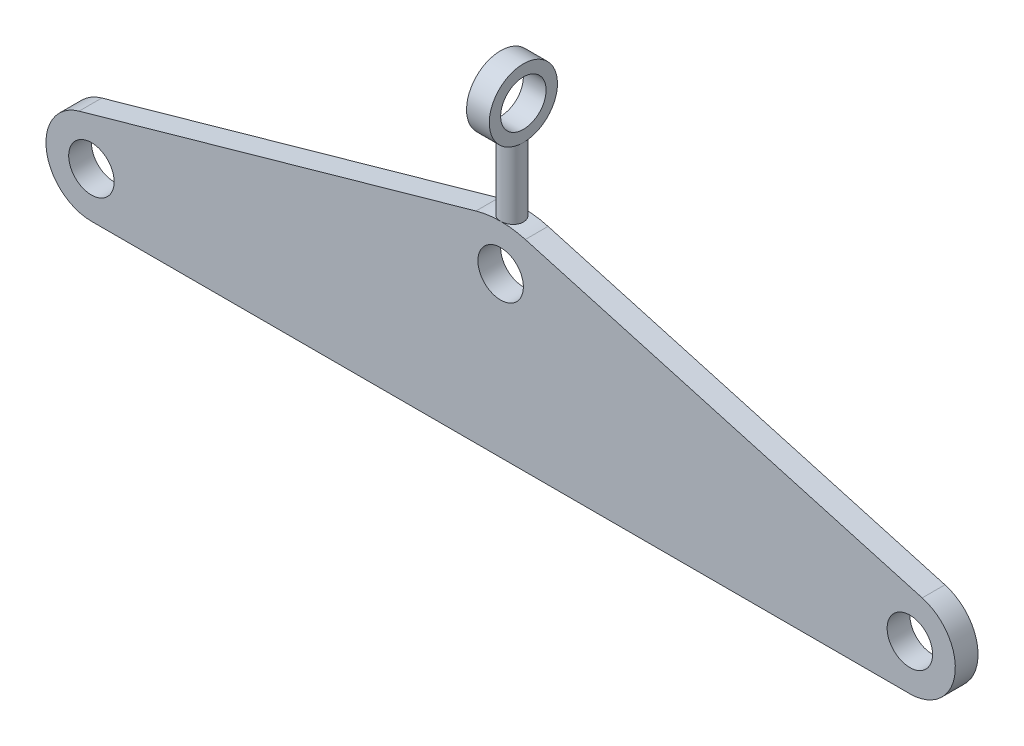
ISO-10303-21;
HEADER;
FILE_DESCRIPTION(('STEP AP214'),'2;1');
FILE_NAME('part.step','',(''),(''),'','','');
FILE_SCHEMA(('AUTOMOTIVE_DESIGN { 1 0 10303 214 1 1 1 1 }'));
ENDSEC;
DATA;
#1=APPLICATION_CONTEXT('core data for automotive mechanical design processes');
#2=APPLICATION_PROTOCOL_DEFINITION('international standard','automotive_design',2000,#1);
#3=PRODUCT_CONTEXT('',#1,'mechanical');
#4=PRODUCT('Part','Part','',(#3));
#5=PRODUCT_RELATED_PRODUCT_CATEGORY('part','',(#4));
#6=PRODUCT_DEFINITION_FORMATION('','',#4);
#7=PRODUCT_DEFINITION_CONTEXT('part definition',#1,'design');
#8=PRODUCT_DEFINITION('design','',#6,#7);
#9=PRODUCT_DEFINITION_SHAPE('','',#8);
#10=(LENGTH_UNIT() NAMED_UNIT(*) SI_UNIT(.MILLI.,.METRE.));
#11=(NAMED_UNIT(*) PLANE_ANGLE_UNIT() SI_UNIT($,.RADIAN.));
#12=(NAMED_UNIT(*) SI_UNIT($,.STERADIAN.) SOLID_ANGLE_UNIT());
#13=UNCERTAINTY_MEASURE_WITH_UNIT(LENGTH_MEASURE(1.E-05),#10,'distance_accuracy_value','');
#14=(GEOMETRIC_REPRESENTATION_CONTEXT(3) GLOBAL_UNCERTAINTY_ASSIGNED_CONTEXT((#13)) GLOBAL_UNIT_ASSIGNED_CONTEXT((#10,
#11,#12)) REPRESENTATION_CONTEXT('',''));
#15=CARTESIAN_POINT('',(0.,0.,0.));
#16=DIRECTION('',(0.,0.,1.));
#17=DIRECTION('',(1.,0.,0.));
#18=AXIS2_PLACEMENT_3D('',#15,#16,#17);
#19=CARTESIAN_POINT('',(0.,49.9999999999999,10.));
#20=DIRECTION('',(0.,0.,-1.));
#21=DIRECTION('',(-1.,0.,0.));
#22=AXIS2_PLACEMENT_3D('',#19,#20,#21);
#23=CYLINDRICAL_SURFACE('',#22,39.9999999999999);
#24=CARTESIAN_POINT('',(0.,49.9999999999999,0.));
#25=DIRECTION('',(0.,0.,1.));
#26=DIRECTION('',(1.,0.,0.));
#27=AXIS2_PLACEMENT_3D('',#24,#25,#26);
#28=CIRCLE('',#27,39.9999999999999);
#29=CARTESIAN_POINT('',(10.8606692422404,88.4973487867754,0.));
#30=VERTEX_POINT('',#29);
#31=CARTESIAN_POINT('',(0.,89.9999999999998,0.));
#32=VERTEX_POINT('',#31);
#33=EDGE_CURVE('E173',#30,#32,#28,.T.);
#34=ORIENTED_EDGE('',*,*,#33,.T.);
#35=CARTESIAN_POINT('',(0.,89.9999999999998,0.));
#36=CARTESIAN_POINT('',(0.139890119905129,90.0000005381635,-1.60544366538232E-06));
#37=CARTESIAN_POINT('',(0.279756672055419,89.9992647084953,0.00587286946751318));
#38=CARTESIAN_POINT('',(0.558534146473235,89.9963430990471,0.0293256522656745));
#39=CARTESIAN_POINT('',(0.697444844924119,89.9941569906196,0.0469066129627251));
#40=CARTESIAN_POINT('',(0.973374569297796,89.9883933720994,0.0936632564356594));
#41=CARTESIAN_POINT('',(1.11039210784001,89.9848148259738,0.122847572954619));
#42=CARTESIAN_POINT('',(1.38150954879871,89.9763659190363,0.192606689859553));
#43=CARTESIAN_POINT('',(1.51560836311209,89.9714950850906,0.233185662387908));
#44=CARTESIAN_POINT('',(1.77974867952928,89.9606049872553,0.325383197050408));
#45=CARTESIAN_POINT('',(1.90979428479121,89.9545869317718,0.37699014991022));
#46=CARTESIAN_POINT('',(2.16511159371552,89.9415653040232,0.490915781149526));
#47=CARTESIAN_POINT('',(2.29038151829058,89.93456136896,0.553238404713552));
#48=CARTESIAN_POINT('',(2.53515746693699,89.9197695937797,0.6880988259054));
#49=CARTESIAN_POINT('',(2.65466661068783,89.9119821851603,0.760631009312634));
#50=CARTESIAN_POINT('',(2.88721115185143,89.89583441741,0.91545219221617));
#51=CARTESIAN_POINT('',(3.00024412947132,89.8874738466495,0.997744803849317));
#52=CARTESIAN_POINT('',(3.2195068068404,89.8703765416527,1.17188491800446));
#53=CARTESIAN_POINT('',(3.32570323025804,89.861638269672,1.26377417064855));
#54=CARTESIAN_POINT('',(3.53002741979653,89.8440638930872,1.45618755632825));
#55=CARTESIAN_POINT('',(3.62815218732707,89.8352277534964,1.55671487026917));
#56=CARTESIAN_POINT('',(3.81557488779227,89.8177127277209,1.76564129127892));
#57=CARTESIAN_POINT('',(3.90487560711771,89.8090337926069,1.87403789456726));
#58=CARTESIAN_POINT('',(4.07409000497663,89.7920724042626,2.0980181969404));
#59=CARTESIAN_POINT('',(4.15400020829439,89.7837900984834,2.21360453273157));
#60=CARTESIAN_POINT('',(4.30405460761977,89.7678365901148,2.45148132538977));
#61=CARTESIAN_POINT('',(4.37416871629248,89.7601672998985,2.57379089547266));
#62=CARTESIAN_POINT('',(4.50386359810221,89.7456849515382,2.82397679510494));
#63=CARTESIAN_POINT('',(4.56344045265627,89.7388722121986,2.95185517363818));
#64=CARTESIAN_POINT('',(4.67157237881494,89.7263059358326,3.2121914879194));
#65=CARTESIAN_POINT('',(4.72013184632197,89.7205519765301,3.34464757278262));
#66=CARTESIAN_POINT('',(4.80591459607033,89.7102634489655,3.61324144907418));
#67=CARTESIAN_POINT('',(4.84313371513166,89.7057293285924,3.74938057266943));
#68=CARTESIAN_POINT('',(4.93694468367964,89.6942156965829,4.16032972480139));
#69=CARTESIAN_POINT('',(4.97637915708482,89.6892420541928,4.43933600976206));
#70=CARTESIAN_POINT('',(5.00788537091916,89.6852781774934,4.99989503088064));
#71=CARTESIAN_POINT('',(4.99995901599065,89.6862877025676,5.28144766418104));
#72=CARTESIAN_POINT('',(4.9372306806791,89.6941397412187,5.8375983606111));
#73=CARTESIAN_POINT('',(4.88269650974368,89.7009489290564,6.11222694590209));
#74=CARTESIAN_POINT('',(4.72870178261049,89.7195838252989,6.64839306899777));
#75=CARTESIAN_POINT('',(4.62924031615997,89.731409635343,6.90993034144571));
#76=CARTESIAN_POINT('',(4.38793084641351,89.75878236299,7.41333518378114));
#77=CARTESIAN_POINT('',(4.24596643413695,89.7743394764763,7.65514638226275));
#78=CARTESIAN_POINT('',(3.92376301219559,89.8074142163636,8.11161360707176));
#79=CARTESIAN_POINT('',(3.7435222518603,89.8249319324207,8.32626839061152));
#80=CARTESIAN_POINT('',(3.34839820167268,89.8601022011234,8.72388536237581));
#81=CARTESIAN_POINT('',(3.13328401036469,89.8777548486257,8.90661816770986));
#82=CARTESIAN_POINT('',(2.67531434354325,89.9110926502287,9.23341777588332));
#83=CARTESIAN_POINT('',(2.43245880406304,89.9267777997925,9.37748448956285));
#84=CARTESIAN_POINT('',(1.92572334129999,89.9544230446088,9.62286263670766));
#85=CARTESIAN_POINT('',(1.66183639028545,89.9663818880917,9.7241597067116));
#86=CARTESIAN_POINT('',(1.12061588125211,89.9852157155399,9.88094098809741));
#87=CARTESIAN_POINT('',(0.843282953394377,89.9920909375099,9.93642734425763));
#88=CARTESIAN_POINT('',(0.285026327694858,89.9999519282222,9.99971484853757));
#89=CARTESIAN_POINT('',(0.0041389802552028,90.0009767228209,10.0078319858305));
#90=CARTESIAN_POINT('',(-0.554992072852981,89.99712676014,9.9769845307859));
#91=CARTESIAN_POINT('',(-0.833235834693511,89.9922521284977,9.93802094110431));
#92=CARTESIAN_POINT('',(-1.37824901587752,89.9771753750005,9.81438058682941));
#93=CARTESIAN_POINT('',(-1.64505314244337,89.9669908157767,9.72985448958346));
#94=CARTESIAN_POINT('',(-2.16069930812282,89.9424344625042,9.51764507978498));
#95=CARTESIAN_POINT('',(-2.409540736989,89.9280625262811,9.38996030183757));
#96=CARTESIAN_POINT('',(-2.88360904734716,89.8966364563236,9.09429378648024));
#97=CARTESIAN_POINT('',(-3.10870754222789,89.8795688738225,8.92610765044472));
#98=CARTESIAN_POINT('',(-3.52759395691155,89.8447028535407,8.55450077486656));
#99=CARTESIAN_POINT('',(-3.72138063328027,89.8269043867707,8.35107863671948));
#100=CARTESIAN_POINT('',(-4.07326400150429,89.7924620828692,7.91338603015325));
#101=CARTESIAN_POINT('',(-4.23115123496748,89.7758253957048,7.6789465391907));
#102=CARTESIAN_POINT('',(-4.50530546506176,89.7457083194623,7.18668027854395));
#103=CARTESIAN_POINT('',(-4.62157329603305,89.7322278671134,6.9288539778228));
#104=CARTESIAN_POINT('',(-4.80885432607943,89.7099966403347,6.39786139323801));
#105=CARTESIAN_POINT('',(-4.87998560998226,89.7012335337282,6.1247371880326));
#106=CARTESIAN_POINT('',(-4.97533563287035,89.6893996880526,5.57015018639667));
#107=CARTESIAN_POINT('',(-4.99955655425284,89.6863286841718,5.28868777850052));
#108=CARTESIAN_POINT('',(-5.00021203982543,89.6862413860478,4.86770509968356));
#109=CARTESIAN_POINT('',(-4.99455342448893,89.6869567678297,4.7279907744482));
#110=CARTESIAN_POINT('',(-4.97156759842697,89.6898435691375,4.44955449545923));
#111=CARTESIAN_POINT('',(-4.95424473440735,89.6920144462687,4.3108321914815));
#112=CARTESIAN_POINT('',(-4.90804527126822,89.6977533828974,4.03531296162436));
#113=CARTESIAN_POINT('',(-4.8791644700839,89.7013219505366,3.89851675475211));
#114=CARTESIAN_POINT('',(-4.81007786270753,89.7097514776593,3.62790627625881));
#115=CARTESIAN_POINT('',(-4.76987617588937,89.7146119670104,3.49409093905426));
#116=CARTESIAN_POINT('',(-4.67843682035611,89.7254873627672,3.23033559589054));
#117=CARTESIAN_POINT('',(-4.62719918212894,89.7315022659838,3.10039557922654));
#118=CARTESIAN_POINT('',(-4.51407883701008,89.7445132115211,2.84534293691755));
#119=CARTESIAN_POINT('',(-4.45219999438846,89.7515088975083,2.72022857899437));
#120=CARTESIAN_POINT('',(-4.31820085845315,89.7662882864808,2.4755993921102));
#121=CARTESIAN_POINT('',(-4.24607681362519,89.7740722778209,2.35608663571795));
#122=CARTESIAN_POINT('',(-4.09214062508197,89.7902044420042,2.12357551708676));
#123=CARTESIAN_POINT('',(-4.01033196639703,89.7985524114373,2.01057483309643));
#124=CARTESIAN_POINT('',(-3.83696646630911,89.8156417227914,1.79104567958628));
#125=CARTESIAN_POINT('',(-3.74534501263956,89.8243854215876,1.68456841212598));
#126=CARTESIAN_POINT('',(-3.5535108005909,89.841960696595,1.47973821996224));
#127=CARTESIAN_POINT('',(-3.45330116889785,89.8507922397984,1.3813823638989));
#128=CARTESIAN_POINT('',(-3.24489676777315,89.8683029909286,1.19338064270281));
#129=CARTESIAN_POINT('',(-3.13669721323722,89.8769821036511,1.10374007275859));
#130=CARTESIAN_POINT('',(-2.91316118457665,89.893934986293,0.933897628967268));
#131=CARTESIAN_POINT('',(-2.79782736151181,89.9022089047573,0.853692280805405));
#132=CARTESIAN_POINT('',(-2.56029300186375,89.9181553288821,0.702934784657389));
#133=CARTESIAN_POINT('',(-2.43806574742476,89.9258251726458,0.632424441172079));
#134=CARTESIAN_POINT('',(-2.18809688735153,89.9403041894307,0.501989324481662));
#135=CARTESIAN_POINT('',(-2.06035732624459,89.9471136779406,0.442060667791041));
#136=CARTESIAN_POINT('',(-1.80032528471159,89.9596765836334,0.333237180143856));
#137=CARTESIAN_POINT('',(-1.66803644956569,89.9654308239913,0.284333741774115));
#138=CARTESIAN_POINT('',(-1.39980201837414,89.9757248289653,0.19787412284095));
#139=CARTESIAN_POINT('',(-1.26385729314416,89.9802648800244,0.160315265671807));
#140=CARTESIAN_POINT('',(-0.942088347754191,89.9893293227842,0.0859095142172747));
#141=CARTESIAN_POINT('',(-0.755150897758084,89.9933140899318,0.0537266080812142));
#142=CARTESIAN_POINT('',(-0.378794555992445,89.9986490545574,0.0107730166012728));
#143=CARTESIAN_POINT('',(-0.189375682531538,89.9999992714628,2.17336277394988E-06));
#144=CARTESIAN_POINT('',(0.,89.9999999999998,0.));
#145=B_SPLINE_CURVE_WITH_KNOTS('',3,(#35,#36,#37,#38,#39,#40,#41,#42,#43,#44,#45,#46,#47,#48,
#49,#50,#51,#52,#53,#54,#55,#56,#57,#58,#59,#60,#61,#62,#63,#64,#65,#66,#67,#68,#69,#70,#71,#72,
#73,#74,#75,#76,#77,#78,#79,#80,#81,#82,#83,#84,#85,#86,#87,#88,#89,#90,#91,#92,#93,#94,#95,#96,
#97,#98,#99,#100,#101,#102,#103,#104,#105,#106,#107,#108,#109,#110,#111,#112,#113,#114,#115,
#116,#117,#118,#119,#120,#121,#122,#123,#124,#125,#126,#127,#128,#129,#130,#131,#132,#133,#134,
#135,#136,#137,#138,#139,#140,#141,#142,#143,#144),.UNSPECIFIED.,.T.,.F.,(4,2,2,2,2,2,2,2,2,2,2,
2,2,2,2,2,2,2,2,2,2,2,2,2,2,2,2,2,2,2,2,2,2,2,2,2,2,2,2,2,2,2,2,2,2,2,2,2,2,2,2,2,2,2,4),(0.,
0.41950463782399,0.839104372080584,1.25901690519861,1.6790833898206,2.0987098253965,
2.51849108679869,2.93804240646987,3.35774948092481,3.77936522319644,4.20113689336975,
4.62277495120627,5.044568559516,5.46763043530053,5.8908493096016,6.3138990227869,
6.73710385606702,7.5781725718573,8.41920746382417,9.25544199496474,10.0916934694557,
10.9302565918416,11.7688580764037,12.6132576288593,13.4576591283932,14.302343980763,
15.1469892842066,15.9859936539694,16.8249801561695,17.6612091439989,18.4974665277099,
19.3380361246994,20.1786390936328,21.0240274962825,21.8693989505618,22.7125495517495,
23.5556609263435,23.9747450940198,24.3936731755016,24.8127537032624,25.2316819351988,
25.6506090098188,26.0693842743665,26.4883132802121,26.9070919891526,27.3288208308208,
27.7503967812451,28.1722272905919,28.5939019805892,29.0173414250539,29.4406251425129,
29.8635772481615,30.2864294856978,30.8543363757697,31.4222390780259),.UNSPECIFIED.);
#146=CARTESIAN_POINT('',(0.,89.9999999999998,10.0000000000001));
#147=VERTEX_POINT('',#146);
#148=EDGE_CURVE('E62',#32,#147,#145,.T.);
#149=ORIENTED_EDGE('',*,*,#148,.T.);
#150=CARTESIAN_POINT('',(0.,49.9999999999999,10.));
#151=DIRECTION('',(0.,0.,1.));
#152=DIRECTION('',(1.,0.,0.));
#153=AXIS2_PLACEMENT_3D('',#150,#151,#152);
#154=CIRCLE('',#153,39.9999999999999);
#155=CARTESIAN_POINT('',(10.8606692422404,88.4973487867754,10.));
#156=VERTEX_POINT('',#155);
#157=EDGE_CURVE('E224',#156,#147,#154,.T.);
#158=ORIENTED_EDGE('',*,*,#157,.F.);
#159=DIRECTION('',(0.,0.,-1.));
#160=VECTOR('',#159,1.);
#161=CARTESIAN_POINT('',(10.8606692422404,88.4973487867754,10.));
#162=LINE('',#161,#160);
#163=EDGE_CURVE('E175',#156,#30,#162,.T.);
#164=ORIENTED_EDGE('',*,*,#163,.T.);
#165=EDGE_LOOP('',(#34,#149,#158,#164));
#166=FACE_BOUND('',#165,.T.);
#167=ADVANCED_FACE('F38',(#166),#23,.T.);
#168=CARTESIAN_POINT('',(180.,20.,10.));
#169=DIRECTION('',(0.,0.,1.));
#170=DIRECTION('',(1.,0.,0.));
#171=AXIS2_PLACEMENT_3D('',#168,#169,#170);
#172=PLANE('',#171);
#173=CARTESIAN_POINT('',(0.,70.,10.));
#174=DIRECTION('',(0.,0.,1.));
#175=DIRECTION('',(1.,0.,0.));
#176=AXIS2_PLACEMENT_3D('',#173,#174,#175);
#177=CIRCLE('',#176,9.99999999999998);
#178=CARTESIAN_POINT('',(9.99999999999998,70.,10.));
#179=VERTEX_POINT('',#178);
#180=EDGE_CURVE('E231',#179,#179,#177,.T.);
#181=ORIENTED_EDGE('',*,*,#180,.F.);
#182=EDGE_LOOP('',(#181));
#183=FACE_BOUND('',#182,.T.);
#184=CARTESIAN_POINT('',(180.,20.,10.));
#185=DIRECTION('',(0.,0.,1.));
#186=DIRECTION('',(1.,0.,0.));
#187=AXIS2_PLACEMENT_3D('',#184,#185,#186);
#188=CIRCLE('',#187,19.9999999999999);
#189=CARTESIAN_POINT('',(180.,0.,10.));
#190=VERTEX_POINT('',#189);
#191=CARTESIAN_POINT('',(185.43033462112,39.2486743933876,10.));
#192=VERTEX_POINT('',#191);
#193=EDGE_CURVE('E189',#190,#192,#188,.T.);
#194=ORIENTED_EDGE('',*,*,#193,.T.);
#195=DIRECTION('',(-0.96243371966939,0.271516731056009,0.));
#196=VECTOR('',#195,1.);
#197=CARTESIAN_POINT('',(185.43033462112,39.2486743933876,10.));
#198=LINE('',#197,#196);
#199=EDGE_CURVE('E206',#192,#156,#198,.T.);
#200=ORIENTED_EDGE('',*,*,#199,.T.);
#201=ORIENTED_EDGE('',*,*,#157,.T.);
#202=CARTESIAN_POINT('',(-10.8606692422404,88.4973487867754,10.));
#203=VERTEX_POINT('',#202);
#204=EDGE_CURVE('E227',#147,#203,#154,.T.);
#205=ORIENTED_EDGE('',*,*,#204,.T.);
#206=DIRECTION('',(-0.96243371966939,-0.271516731056009,0.));
#207=VECTOR('',#206,1.);
#208=CARTESIAN_POINT('',(-10.8606692422404,88.4973487867754,10.));
#209=LINE('',#208,#207);
#210=CARTESIAN_POINT('',(-185.43033462112,39.2486743933878,10.));
#211=VERTEX_POINT('',#210);
#212=EDGE_CURVE('E222',#203,#211,#209,.T.);
#213=ORIENTED_EDGE('',*,*,#212,.T.);
#214=CARTESIAN_POINT('',(-180.,20.,10.));
#215=DIRECTION('',(0.,0.,1.));
#216=DIRECTION('',(-1.,0.,0.));
#217=AXIS2_PLACEMENT_3D('',#214,#215,#216);
#218=CIRCLE('',#217,19.9999999999999);
#219=CARTESIAN_POINT('',(-180.,0.,10.));
#220=VERTEX_POINT('',#219);
#221=EDGE_CURVE('E220',#211,#220,#218,.T.);
#222=ORIENTED_EDGE('',*,*,#221,.T.);
#223=DIRECTION('',(1.,0.,0.));
#224=VECTOR('',#223,1.);
#225=CARTESIAN_POINT('',(-180.,0.,10.));
#226=LINE('',#225,#224);
#227=EDGE_CURVE('E194',#220,#190,#226,.T.);
#228=ORIENTED_EDGE('',*,*,#227,.T.);
#229=EDGE_LOOP('',(#194,#200,#201,#205,#213,#222,#228));
#230=FACE_BOUND('',#229,.T.);
#231=CARTESIAN_POINT('',(180.,20.,10.));
#232=DIRECTION('',(0.,0.,1.));
#233=DIRECTION('',(1.,0.,0.));
#234=AXIS2_PLACEMENT_3D('',#231,#232,#233);
#235=CIRCLE('',#234,10.);
#236=CARTESIAN_POINT('',(190.,20.,10.));
#237=VERTEX_POINT('',#236);
#238=EDGE_CURVE('E214',#237,#237,#235,.T.);
#239=ORIENTED_EDGE('',*,*,#238,.F.);
#240=EDGE_LOOP('',(#239));
#241=FACE_BOUND('',#240,.T.);
#242=CARTESIAN_POINT('',(-180.,20.,10.));
#243=DIRECTION('',(0.,0.,1.));
#244=DIRECTION('',(1.,0.,0.));
#245=AXIS2_PLACEMENT_3D('',#242,#243,#244);
#246=CIRCLE('',#245,10.0000000000001);
#247=CARTESIAN_POINT('',(-170.,20.,10.));
#248=VERTEX_POINT('',#247);
#249=EDGE_CURVE('E236',#248,#248,#246,.T.);
#250=ORIENTED_EDGE('',*,*,#249,.F.);
#251=EDGE_LOOP('',(#250));
#252=FACE_BOUND('',#251,.T.);
#253=ADVANCED_FACE('F146',(#183,#230,#241,#252),#172,.T.);
#254=CARTESIAN_POINT('',(180.,20.,0.));
#255=DIRECTION('',(0.,0.,1.));
#256=DIRECTION('',(1.,0.,0.));
#257=AXIS2_PLACEMENT_3D('',#254,#255,#256);
#258=PLANE('',#257);
#259=CARTESIAN_POINT('',(180.,20.,0.));
#260=DIRECTION('',(0.,0.,1.));
#261=DIRECTION('',(1.,0.,0.));
#262=AXIS2_PLACEMENT_3D('',#259,#260,#261);
#263=CIRCLE('',#262,19.9999999999999);
#264=CARTESIAN_POINT('',(180.,0.,0.));
#265=VERTEX_POINT('',#264);
#266=CARTESIAN_POINT('',(185.43033462112,39.2486743933876,0.));
#267=VERTEX_POINT('',#266);
#268=EDGE_CURVE('E211',#265,#267,#263,.T.);
#269=ORIENTED_EDGE('',*,*,#268,.F.);
#270=DIRECTION('',(1.,0.,0.));
#271=VECTOR('',#270,1.);
#272=CARTESIAN_POINT('',(-180.,0.,0.));
#273=LINE('',#272,#271);
#274=CARTESIAN_POINT('',(-180.,0.,0.));
#275=VERTEX_POINT('',#274);
#276=EDGE_CURVE('E187',#275,#265,#273,.T.);
#277=ORIENTED_EDGE('',*,*,#276,.F.);
#278=CARTESIAN_POINT('',(-180.,20.,0.));
#279=DIRECTION('',(0.,0.,1.));
#280=DIRECTION('',(-1.,0.,0.));
#281=AXIS2_PLACEMENT_3D('',#278,#279,#280);
#282=CIRCLE('',#281,19.9999999999999);
#283=CARTESIAN_POINT('',(-185.43033462112,39.2486743933878,0.));
#284=VERTEX_POINT('',#283);
#285=EDGE_CURVE('E180',#284,#275,#282,.T.);
#286=ORIENTED_EDGE('',*,*,#285,.F.);
#287=DIRECTION('',(-0.96243371966939,-0.271516731056009,0.));
#288=VECTOR('',#287,1.);
#289=CARTESIAN_POINT('',(-10.8606692422404,88.4973487867754,0.));
#290=LINE('',#289,#288);
#291=CARTESIAN_POINT('',(-10.8606692422404,88.4973487867754,0.));
#292=VERTEX_POINT('',#291);
#293=EDGE_CURVE('E177',#292,#284,#290,.T.);
#294=ORIENTED_EDGE('',*,*,#293,.F.);
#295=EDGE_CURVE('E178',#32,#292,#28,.T.);
#296=ORIENTED_EDGE('',*,*,#295,.F.);
#297=ORIENTED_EDGE('',*,*,#33,.F.);
#298=DIRECTION('',(-0.96243371966939,0.271516731056009,0.));
#299=VECTOR('',#298,1.);
#300=CARTESIAN_POINT('',(185.43033462112,39.2486743933876,0.));
#301=LINE('',#300,#299);
#302=EDGE_CURVE('E182',#267,#30,#301,.T.);
#303=ORIENTED_EDGE('',*,*,#302,.F.);
#304=EDGE_LOOP('',(#269,#277,#286,#294,#296,#297,#303));
#305=FACE_BOUND('',#304,.T.);
#306=CARTESIAN_POINT('',(180.,20.,0.));
#307=DIRECTION('',(0.,0.,1.));
#308=DIRECTION('',(1.,0.,0.));
#309=AXIS2_PLACEMENT_3D('',#306,#307,#308);
#310=CIRCLE('',#309,10.);
#311=CARTESIAN_POINT('',(190.,20.,0.));
#312=VERTEX_POINT('',#311);
#313=EDGE_CURVE('E216',#312,#312,#310,.T.);
#314=ORIENTED_EDGE('',*,*,#313,.T.);
#315=EDGE_LOOP('',(#314));
#316=FACE_BOUND('',#315,.T.);
#317=CARTESIAN_POINT('',(0.,70.,0.));
#318=DIRECTION('',(0.,0.,1.));
#319=DIRECTION('',(1.,0.,0.));
#320=AXIS2_PLACEMENT_3D('',#317,#318,#319);
#321=CIRCLE('',#320,9.99999999999998);
#322=CARTESIAN_POINT('',(9.99999999999998,70.,0.));
#323=VERTEX_POINT('',#322);
#324=EDGE_CURVE('E233',#323,#323,#321,.T.);
#325=ORIENTED_EDGE('',*,*,#324,.T.);
#326=EDGE_LOOP('',(#325));
#327=FACE_BOUND('',#326,.T.);
#328=CARTESIAN_POINT('',(-180.,20.,0.));
#329=DIRECTION('',(0.,0.,1.));
#330=DIRECTION('',(1.,0.,0.));
#331=AXIS2_PLACEMENT_3D('',#328,#329,#330);
#332=CIRCLE('',#331,10.0000000000001);
#333=CARTESIAN_POINT('',(-170.,20.,0.));
#334=VERTEX_POINT('',#333);
#335=EDGE_CURVE('E239',#334,#334,#332,.T.);
#336=ORIENTED_EDGE('',*,*,#335,.T.);
#337=EDGE_LOOP('',(#336));
#338=FACE_BOUND('',#337,.T.);
#339=ADVANCED_FACE('F149',(#305,#316,#327,#338),#258,.F.);
#340=CARTESIAN_POINT('',(180.,20.,10.));
#341=DIRECTION('',(0.,0.,-1.));
#342=DIRECTION('',(-1.,0.,0.));
#343=AXIS2_PLACEMENT_3D('',#340,#341,#342);
#344=CYLINDRICAL_SURFACE('',#343,19.9999999999999);
#345=ORIENTED_EDGE('',*,*,#268,.T.);
#346=DIRECTION('',(0.,0.,-1.));
#347=VECTOR('',#346,1.);
#348=CARTESIAN_POINT('',(185.43033462112,39.2486743933876,10.));
#349=LINE('',#348,#347);
#350=EDGE_CURVE('E117',#192,#267,#349,.T.);
#351=ORIENTED_EDGE('',*,*,#350,.F.);
#352=ORIENTED_EDGE('',*,*,#193,.F.);
#353=DIRECTION('',(0.,0.,-1.));
#354=VECTOR('',#353,1.);
#355=CARTESIAN_POINT('',(180.,0.,10.));
#356=LINE('',#355,#354);
#357=EDGE_CURVE('E190',#190,#265,#356,.T.);
#358=ORIENTED_EDGE('',*,*,#357,.T.);
#359=EDGE_LOOP('',(#345,#351,#352,#358));
#360=FACE_BOUND('',#359,.T.);
#361=ADVANCED_FACE('F40',(#360),#344,.T.);
#362=CARTESIAN_POINT('',(185.43033462112,39.2486743933876,10.));
#363=DIRECTION('',(-0.271516731056009,-0.96243371966939,0.));
#364=DIRECTION('',(0.962433719669391,-0.271516731056009,0.));
#365=AXIS2_PLACEMENT_3D('',#362,#363,#364);
#366=PLANE('',#365);
#367=ORIENTED_EDGE('',*,*,#302,.T.);
#368=ORIENTED_EDGE('',*,*,#163,.F.);
#369=ORIENTED_EDGE('',*,*,#199,.F.);
#370=ORIENTED_EDGE('',*,*,#350,.T.);
#371=EDGE_LOOP('',(#367,#368,#369,#370));
#372=FACE_BOUND('',#371,.T.);
#373=ADVANCED_FACE('F166',(#372),#366,.F.);
#374=ORIENTED_EDGE('',*,*,#204,.F.);
#375=EDGE_CURVE('E112',#147,#32,#145,.T.);
#376=ORIENTED_EDGE('',*,*,#375,.T.);
#377=ORIENTED_EDGE('',*,*,#295,.T.);
#378=DIRECTION('',(0.,0.,-1.));
#379=VECTOR('',#378,1.);
#380=CARTESIAN_POINT('',(-10.8606692422404,88.4973487867754,10.));
#381=LINE('',#380,#379);
#382=EDGE_CURVE('E200',#203,#292,#381,.T.);
#383=ORIENTED_EDGE('',*,*,#382,.F.);
#384=EDGE_LOOP('',(#374,#376,#377,#383));
#385=FACE_BOUND('',#384,.T.);
#386=ADVANCED_FACE('F124',(#385),#23,.T.);
#387=CARTESIAN_POINT('',(-10.8606692422404,88.4973487867754,10.));
#388=DIRECTION('',(0.271516731056009,-0.96243371966939,0.));
#389=DIRECTION('',(0.962433719669391,0.27151673105601,0.));
#390=AXIS2_PLACEMENT_3D('',#387,#388,#389);
#391=PLANE('',#390);
#392=ORIENTED_EDGE('',*,*,#293,.T.);
#393=DIRECTION('',(0.,0.,-1.));
#394=VECTOR('',#393,1.);
#395=CARTESIAN_POINT('',(-185.43033462112,39.2486743933878,10.));
#396=LINE('',#395,#394);
#397=EDGE_CURVE('E197',#211,#284,#396,.T.);
#398=ORIENTED_EDGE('',*,*,#397,.F.);
#399=ORIENTED_EDGE('',*,*,#212,.F.);
#400=ORIENTED_EDGE('',*,*,#382,.T.);
#401=EDGE_LOOP('',(#392,#398,#399,#400));
#402=FACE_BOUND('',#401,.T.);
#403=ADVANCED_FACE('F159',(#402),#391,.F.);
#404=CARTESIAN_POINT('',(-180.,20.,10.));
#405=DIRECTION('',(0.,0.,-1.));
#406=DIRECTION('',(-1.,0.,0.));
#407=AXIS2_PLACEMENT_3D('',#404,#405,#406);
#408=CYLINDRICAL_SURFACE('',#407,19.9999999999999);
#409=ORIENTED_EDGE('',*,*,#285,.T.);
#410=DIRECTION('',(0.,0.,-1.));
#411=VECTOR('',#410,1.);
#412=CARTESIAN_POINT('',(-180.,0.,10.));
#413=LINE('',#412,#411);
#414=EDGE_CURVE('E193',#220,#275,#413,.T.);
#415=ORIENTED_EDGE('',*,*,#414,.F.);
#416=ORIENTED_EDGE('',*,*,#221,.F.);
#417=ORIENTED_EDGE('',*,*,#397,.T.);
#418=EDGE_LOOP('',(#409,#415,#416,#417));
#419=FACE_BOUND('',#418,.T.);
#420=ADVANCED_FACE('F156',(#419),#408,.T.);
#421=CARTESIAN_POINT('',(-180.,0.,10.));
#422=DIRECTION('',(0.,1.,0.));
#423=DIRECTION('',(0.,0.,1.));
#424=AXIS2_PLACEMENT_3D('',#421,#422,#423);
#425=PLANE('',#424);
#426=ORIENTED_EDGE('',*,*,#276,.T.);
#427=ORIENTED_EDGE('',*,*,#357,.F.);
#428=ORIENTED_EDGE('',*,*,#227,.F.);
#429=ORIENTED_EDGE('',*,*,#414,.T.);
#430=EDGE_LOOP('',(#426,#427,#428,#429));
#431=FACE_BOUND('',#430,.T.);
#432=ADVANCED_FACE('F144',(#431),#425,.F.);
#433=CARTESIAN_POINT('',(180.,20.,10.));
#434=DIRECTION('',(0.,0.,-1.));
#435=DIRECTION('',(-1.,0.,0.));
#436=AXIS2_PLACEMENT_3D('',#433,#434,#435);
#437=CYLINDRICAL_SURFACE('',#436,10.);
#438=ORIENTED_EDGE('',*,*,#238,.T.);
#439=EDGE_LOOP('',(#438));
#440=FACE_BOUND('',#439,.T.);
#441=ORIENTED_EDGE('',*,*,#313,.F.);
#442=EDGE_LOOP('',(#441));
#443=FACE_BOUND('',#442,.T.);
#444=ADVANCED_FACE('F140',(#440,#443),#437,.F.);
#445=CARTESIAN_POINT('',(0.,70.,10.));
#446=DIRECTION('',(0.,0.,-1.));
#447=DIRECTION('',(-1.,0.,0.));
#448=AXIS2_PLACEMENT_3D('',#445,#446,#447);
#449=CYLINDRICAL_SURFACE('',#448,9.99999999999998);
#450=ORIENTED_EDGE('',*,*,#180,.T.);
#451=EDGE_LOOP('',(#450));
#452=FACE_BOUND('',#451,.T.);
#453=ORIENTED_EDGE('',*,*,#324,.F.);
#454=EDGE_LOOP('',(#453));
#455=FACE_BOUND('',#454,.T.);
#456=ADVANCED_FACE('F136',(#452,#455),#449,.F.);
#457=CARTESIAN_POINT('',(-180.,20.,10.));
#458=DIRECTION('',(0.,0.,-1.));
#459=DIRECTION('',(-1.,0.,0.));
#460=AXIS2_PLACEMENT_3D('',#457,#458,#459);
#461=CYLINDRICAL_SURFACE('',#460,10.0000000000001);
#462=ORIENTED_EDGE('',*,*,#249,.T.);
#463=EDGE_LOOP('',(#462));
#464=FACE_BOUND('',#463,.T.);
#465=ORIENTED_EDGE('',*,*,#335,.F.);
#466=EDGE_LOOP('',(#465));
#467=FACE_BOUND('',#466,.T.);
#468=ADVANCED_FACE('F130',(#464,#467),#461,.F.);
#469=CARTESIAN_POINT('',(0.,125.,5.00000000000001));
#470=DIRECTION('',(0.,-1.,0.));
#471=DIRECTION('',(0.,0.,-1.));
#472=AXIS2_PLACEMENT_3D('',#469,#470,#471);
#473=CYLINDRICAL_SURFACE('',#472,5.00000000000004);
#474=CARTESIAN_POINT('',(0.,120.857864376269,0.));
#475=CARTESIAN_POINT('',(-0.272340874180362,120.857865273478,-1.28973859745586E-06));
#476=CARTESIAN_POINT('',(-0.544673999117968,120.849911535457,0.0223260815723556));
#477=CARTESIAN_POINT('',(-1.08127210497125,120.819121295937,0.110744341555926));
#478=CARTESIAN_POINT('',(-1.34553574936236,120.796282342891,0.176842439157982));
#479=CARTESIAN_POINT('',(-1.85813446498645,120.73858981556,0.350222571575445));
#480=CARTESIAN_POINT('',(-2.1064996472136,120.703759801434,0.457423892983743));
#481=CARTESIAN_POINT('',(-2.58180024273983,120.626043899484,0.709691857793068));
#482=CARTESIAN_POINT('',(-2.80873091276818,120.583156234819,0.854766855699059));
#483=CARTESIAN_POINT('',(-3.24359981169159,120.492275529626,1.18474426778559));
#484=CARTESIAN_POINT('',(-3.45057714335867,120.444155257768,1.37087829311038));
#485=CARTESIAN_POINT('',(-3.83103400612323,120.34930675995,1.77506166392801));
#486=CARTESIAN_POINT('',(-4.00450815791188,120.302578758552,1.99311612473811));
#487=CARTESIAN_POINT('',(-4.317394486648,120.21430665391,2.46197746017494));
#488=CARTESIAN_POINT('',(-4.45579985308983,120.17292961492,2.71349044387736));
#489=CARTESIAN_POINT('',(-4.68795792563759,120.101520661451,3.23784388506263));
#490=CARTESIAN_POINT('',(-4.78172266588457,120.07148568985,3.51067857156394));
#491=CARTESIAN_POINT('',(-4.91867927316201,120.027046228405,4.05985591283253));
#492=CARTESIAN_POINT('',(-4.96351723128508,120.012134261122,4.33574622573516));
#493=CARTESIAN_POINT('',(-5.00658146680334,119.997819589088,4.89151062587956));
#494=CARTESIAN_POINT('',(-5.00481975826211,119.998412886855,5.17138366771949));
#495=CARTESIAN_POINT('',(-4.9557787271699,120.014698019063,5.71551757596909));
#496=CARTESIAN_POINT('',(-4.9102873576276,120.029796762244,5.9799602429583));
#497=CARTESIAN_POINT('',(-4.77803509509768,120.072651633013,6.49721719411088));
#498=CARTESIAN_POINT('',(-4.69127140510092,120.100408618441,6.7500306888961));
#499=CARTESIAN_POINT('',(-4.47789341346975,120.166216485339,7.24076237420989));
#500=CARTESIAN_POINT('',(-4.35077030726748,120.204397873799,7.47844110484426));
#501=CARTESIAN_POINT('',(-4.06070147275676,120.287080348054,7.92962162763665));
#502=CARTESIAN_POINT('',(-3.89774578336188,120.331583189927,8.14311667192674));
#503=CARTESIAN_POINT('',(-3.53162803270154,120.424690407505,8.55050433275658));
#504=CARTESIAN_POINT('',(-3.32693421079263,120.473389241556,8.7430007853264));
#505=CARTESIAN_POINT('',(-2.88775637136694,120.567633237555,9.09138629799091));
#506=CARTESIAN_POINT('',(-2.65326777135981,120.613177912719,9.24726971640776));
#507=CARTESIAN_POINT('',(-2.15673187198282,120.696473743944,9.51993727517876));
#508=CARTESIAN_POINT('',(-1.89433934341115,120.734104535763,9.63613231810675));
#509=CARTESIAN_POINT('',(-1.35214302892793,120.795917458781,9.82221596634673));
#510=CARTESIAN_POINT('',(-1.07234659396878,120.820105225645,9.89212397873752));
#511=CARTESIAN_POINT('',(-0.516808222942136,120.851018184221,9.98080641048766));
#512=CARTESIAN_POINT('',(-0.241452876256726,120.858481984062,10.0017454775382));
#513=CARTESIAN_POINT('',(0.308880745570532,120.857166397041,9.99802719454865));
#514=CARTESIAN_POINT('',(0.583859080119943,120.848389960409,9.97337812613387));
#515=CARTESIAN_POINT('',(1.11578482855955,120.816319095485,9.8811282577616));
#516=CARTESIAN_POINT('',(1.37302715075421,120.793533727958,9.81503196990347));
#517=CARTESIAN_POINT('',(1.87271803119593,120.736572316449,9.64356931280239));
#518=CARTESIAN_POINT('',(2.11516395795391,120.702394253258,9.53819598181716));
#519=CARTESIAN_POINT('',(2.58690210423501,120.625156120211,9.28737170369473));
#520=CARTESIAN_POINT('',(2.81553321320903,120.581848716719,9.14075559179253));
#521=CARTESIAN_POINT('',(3.24573026191862,120.491711563452,8.81292815278784));
#522=CARTESIAN_POINT('',(3.44728819330612,120.44488077781,8.63170662749395));
#523=CARTESIAN_POINT('',(3.82763992045322,120.350248068108,8.22945852950167));
#524=CARTESIAN_POINT('',(4.00487195009428,120.302507821105,8.0069363527333));
#525=CARTESIAN_POINT('',(4.31958071174025,120.213657419345,7.53413645700132));
#526=CARTESIAN_POINT('',(4.45705885581216,120.172547029115,7.2838597243228));
#527=CARTESIAN_POINT('',(4.68710052430861,120.10177970947,6.76389931216151));
#528=CARTESIAN_POINT('',(4.77995638574037,120.072048499773,6.49435561660601));
#529=CARTESIAN_POINT('',(4.91863871030056,120.027069458111,5.94229232923011));
#530=CARTESIAN_POINT('',(4.96448214940256,120.011816398299,5.65977745976947));
#531=CARTESIAN_POINT('',(5.00631038802825,119.997906838187,5.10407667930022));
#532=CARTESIAN_POINT('',(5.00453726966193,119.998503995528,4.83107638039992));
#533=CARTESIAN_POINT('',(4.956713459268,120.01439017403,4.28944427499914));
#534=CARTESIAN_POINT('',(4.9106663592362,120.029678003321,4.02081211590472));
#535=CARTESIAN_POINT('',(4.77708882712023,120.072954252279,3.49978940283971));
#536=CARTESIAN_POINT('',(4.69022892323538,120.100737081943,3.24720864543605));
#537=CARTESIAN_POINT('',(4.47811234451427,120.166141964775,2.76010824530102));
#538=CARTESIAN_POINT('',(4.35284872401498,120.203765797599,2.52559187928783));
#539=CARTESIAN_POINT('',(4.06215243949,120.286706558606,2.07182991845607));
#540=CARTESIAN_POINT('',(3.89540657309184,120.332256375404,1.85346874221195));
#541=CARTESIAN_POINT('',(3.52871304421907,120.425350560406,1.44709486863785));
#542=CARTESIAN_POINT('',(3.3287547886864,120.472895561345,1.25909189187703));
#543=CARTESIAN_POINT('',(2.89195322206529,120.56683600872,0.911290955834394));
#544=CARTESIAN_POINT('',(2.65397244511683,120.613113600568,0.752885170010477));
#545=CARTESIAN_POINT('',(2.15332786548613,120.696990333849,0.478428283494401));
#546=CARTESIAN_POINT('',(1.8906705348517,120.734591741938,0.362366115902601));
#547=CARTESIAN_POINT('',(1.36019087992186,120.794933289674,0.180780858979142));
#548=CARTESIAN_POINT('',(1.09313868237318,120.818268357141,0.113210454252371));
#549=CARTESIAN_POINT('',(0.550719747666499,120.849730823024,0.022828399253632));
#550=CARTESIAN_POINT('',(0.275355912946458,120.857863469127,1.30401700435756E-06));
#551=CARTESIAN_POINT('',(0.,120.857864376269,0.));
#552=B_SPLINE_CURVE_WITH_KNOTS('',3,(#474,#475,#476,#477,#478,#479,#480,#481,#482,#483,#484,
#485,#486,#487,#488,#489,#490,#491,#492,#493,#494,#495,#496,#497,#498,#499,#500,#501,#502,#503,
#504,#505,#506,#507,#508,#509,#510,#511,#512,#513,#514,#515,#516,#517,#518,#519,#520,#521,#522,
#523,#524,#525,#526,#527,#528,#529,#530,#531,#532,#533,#534,#535,#536,#537,#538,#539,#540,#541,
#542,#543,#544,#545,#546,#547,#548,#549,#550,#551),.UNSPECIFIED.,.T.,.F.,(4,2,2,2,2,2,2,2,2,2,2,
2,2,2,2,2,2,2,2,2,2,2,2,2,2,2,2,2,2,2,2,2,2,2,2,2,2,2,4),(0.,0.816002923996785,1.63214027507583,
2.44668313750416,3.26140583092724,4.10506687137844,4.94886325859944,5.81467530718291,
6.68025381933951,7.51571593824678,8.35096266511643,9.15345024127853,9.95599220946192,
10.7690827430168,11.5823995937012,12.434008718196,13.2857489806054,14.1496319921529,
15.0131525678309,15.8377145682221,16.6621267918618,17.458219788439,18.2544539573474,
19.0759428867859,19.8976742831065,20.7589404085548,21.6201759378768,22.4756895595428,
23.330894150208,24.145904233882,24.9608482004893,25.7628478020217,26.5649925381624,
27.3967759760319,28.2288252216318,29.0934451368075,29.9578389133436,30.7831606081348,
31.6081973595235),.UNSPECIFIED.);
#553=CARTESIAN_POINT('',(-5.,120.,5.00000000000001));
#554=VERTEX_POINT('',#553);
#555=CARTESIAN_POINT('',(5.,120.,5.00000000000001));
#556=VERTEX_POINT('',#555);
#557=EDGE_CURVE('E11',#554,#556,#552,.T.);
#558=ORIENTED_EDGE('',*,*,#557,.F.);
#559=EDGE_CURVE('E42',#556,#554,#552,.T.);
#560=ORIENTED_EDGE('',*,*,#559,.F.);
#561=EDGE_LOOP('',(#558,#560));
#562=FACE_BOUND('',#561,.T.);
#563=ORIENTED_EDGE('',*,*,#148,.F.);
#564=ORIENTED_EDGE('',*,*,#375,.F.);
#565=EDGE_LOOP('',(#563,#564));
#566=FACE_BOUND('',#565,.T.);
#567=ADVANCED_FACE('F103',(#562,#566),#473,.T.);
#568=CARTESIAN_POINT('',(-5.,135.,5.00000000000001));
#569=DIRECTION('',(1.,0.,0.));
#570=DIRECTION('',(0.,0.,-1.));
#571=AXIS2_PLACEMENT_3D('',#568,#569,#570);
#572=CYLINDRICAL_SURFACE('',#571,15.);
#573=CARTESIAN_POINT('',(-5.,135.,5.00000000000001));
#574=DIRECTION('',(1.,0.,0.));
#575=DIRECTION('',(0.,0.,-1.));
#576=AXIS2_PLACEMENT_3D('',#573,#574,#575);
#577=CIRCLE('',#576,15.);
#578=EDGE_CURVE('E110',#554,#554,#577,.T.);
#579=ORIENTED_EDGE('',*,*,#578,.T.);
#580=ORIENTED_EDGE('',*,*,#557,.T.);
#581=CARTESIAN_POINT('',(5.,135.,5.00000000000001));
#582=DIRECTION('',(1.,0.,0.));
#583=DIRECTION('',(0.,0.,-1.));
#584=AXIS2_PLACEMENT_3D('',#581,#582,#583);
#585=CIRCLE('',#584,15.);
#586=EDGE_CURVE('E111',#556,#556,#585,.T.);
#587=ORIENTED_EDGE('',*,*,#586,.F.);
#588=ORIENTED_EDGE('',*,*,#559,.T.);
#589=EDGE_LOOP('',(#579,#580,#587,#588));
#590=FACE_BOUND('',#589,.T.);
#591=ADVANCED_FACE('F108',(#590),#572,.T.);
#592=CARTESIAN_POINT('',(-5.,135.,5.00000000000001));
#593=DIRECTION('',(1.,0.,0.));
#594=DIRECTION('',(0.,0.,-1.));
#595=AXIS2_PLACEMENT_3D('',#592,#593,#594);
#596=PLANE('',#595);
#597=CARTESIAN_POINT('',(-5.,135.,5.00000000000001));
#598=DIRECTION('',(1.,0.,0.));
#599=DIRECTION('',(0.,0.,-1.));
#600=AXIS2_PLACEMENT_3D('',#597,#598,#599);
#601=CIRCLE('',#600,10.);
#602=CARTESIAN_POINT('',(-5.,135.,-5.));
#603=VERTEX_POINT('',#602);
#604=EDGE_CURVE('E245',#603,#603,#601,.T.);
#605=ORIENTED_EDGE('',*,*,#604,.T.);
#606=EDGE_LOOP('',(#605));
#607=FACE_BOUND('',#606,.T.);
#608=ORIENTED_EDGE('',*,*,#578,.F.);
#609=EDGE_LOOP('',(#608));
#610=FACE_BOUND('',#609,.T.);
#611=ADVANCED_FACE('F263',(#607,#610),#596,.F.);
#612=CARTESIAN_POINT('',(-5.,135.,5.00000000000001));
#613=DIRECTION('',(1.,0.,0.));
#614=DIRECTION('',(0.,0.,-1.));
#615=AXIS2_PLACEMENT_3D('',#612,#613,#614);
#616=CYLINDRICAL_SURFACE('',#615,10.);
#617=CARTESIAN_POINT('',(5.,135.,5.00000000000001));
#618=DIRECTION('',(1.,0.,0.));
#619=DIRECTION('',(0.,0.,-1.));
#620=AXIS2_PLACEMENT_3D('',#617,#618,#619);
#621=CIRCLE('',#620,10.);
#622=CARTESIAN_POINT('',(5.,135.,-5.));
#623=VERTEX_POINT('',#622);
#624=EDGE_CURVE('E249',#623,#623,#621,.T.);
#625=ORIENTED_EDGE('',*,*,#624,.T.);
#626=EDGE_LOOP('',(#625));
#627=FACE_BOUND('',#626,.T.);
#628=ORIENTED_EDGE('',*,*,#604,.F.);
#629=EDGE_LOOP('',(#628));
#630=FACE_BOUND('',#629,.T.);
#631=ADVANCED_FACE('F253',(#627,#630),#616,.F.);
#632=CARTESIAN_POINT('',(5.,135.,5.00000000000001));
#633=DIRECTION('',(1.,0.,0.));
#634=DIRECTION('',(0.,0.,-1.));
#635=AXIS2_PLACEMENT_3D('',#632,#633,#634);
#636=PLANE('',#635);
#637=ORIENTED_EDGE('',*,*,#624,.F.);
#638=EDGE_LOOP('',(#637));
#639=FACE_BOUND('',#638,.T.);
#640=ORIENTED_EDGE('',*,*,#586,.T.);
#641=EDGE_LOOP('',(#640));
#642=FACE_BOUND('',#641,.T.);
#643=ADVANCED_FACE('F256',(#639,#642),#636,.T.);
#644=CLOSED_SHELL('',(#167,#253,#339,#361,#373,#386,#403,#420,#432,#444,#456,#468,#567,#591,
#611,#631,#643));
#645=MANIFOLD_SOLID_BREP('B2',#644);
#646=ADVANCED_BREP_SHAPE_REPRESENTATION('',(#18,#645),#14);
#647=SHAPE_DEFINITION_REPRESENTATION(#9,#646);
ENDSEC;
END-ISO-10303-21;
